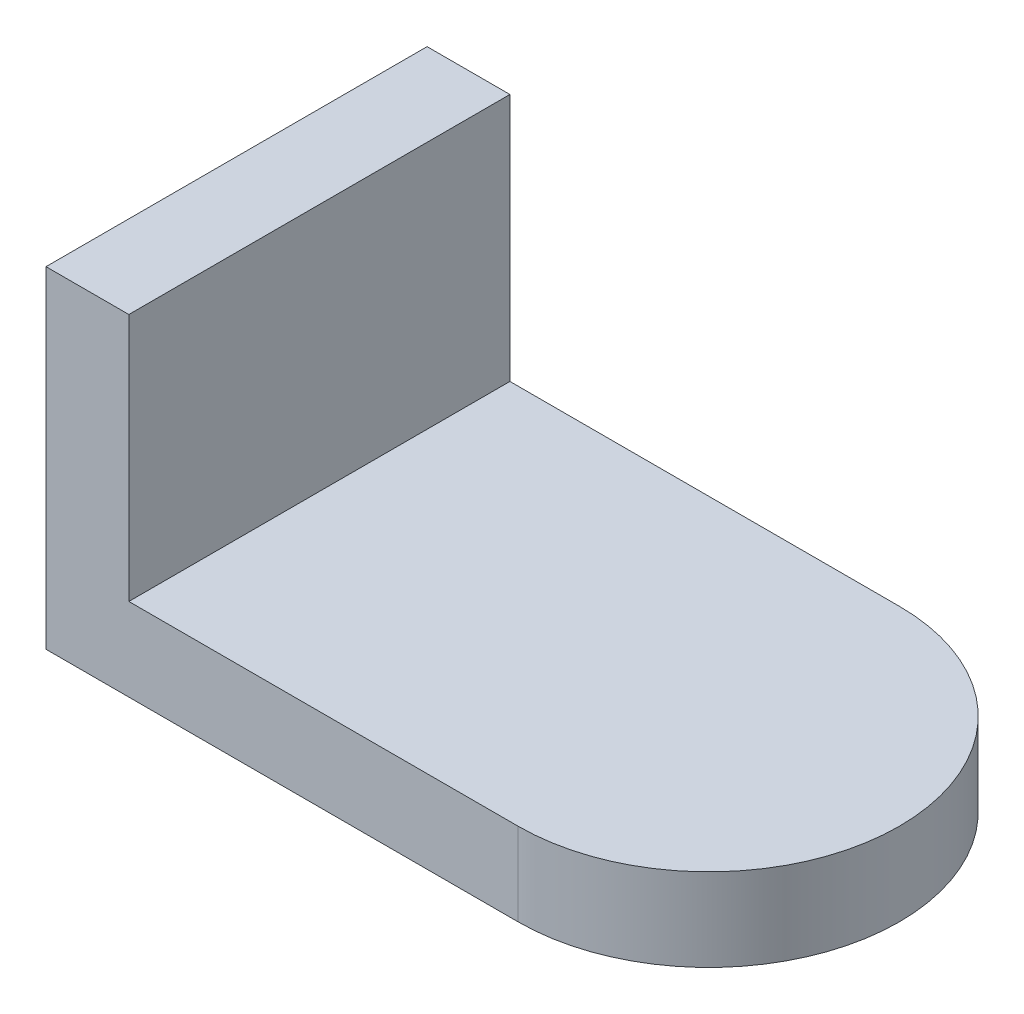
ISO-10303-21;
HEADER;
FILE_DESCRIPTION(('STEP AP214'),'2;1');
FILE_NAME('part.step','',(''),(''),'','','');
FILE_SCHEMA(('AUTOMOTIVE_DESIGN { 1 0 10303 214 1 1 1 1 }'));
ENDSEC;
DATA;
#1=APPLICATION_CONTEXT('core data for automotive mechanical design processes');
#2=APPLICATION_PROTOCOL_DEFINITION('international standard','automotive_design',2000,#1);
#3=PRODUCT_CONTEXT('',#1,'mechanical');
#4=PRODUCT('Part','Part','',(#3));
#5=PRODUCT_RELATED_PRODUCT_CATEGORY('part','',(#4));
#6=PRODUCT_DEFINITION_FORMATION('','',#4);
#7=PRODUCT_DEFINITION_CONTEXT('part definition',#1,'design');
#8=PRODUCT_DEFINITION('design','',#6,#7);
#9=PRODUCT_DEFINITION_SHAPE('','',#8);
#10=(LENGTH_UNIT() NAMED_UNIT(*) SI_UNIT(.MILLI.,.METRE.));
#11=(NAMED_UNIT(*) PLANE_ANGLE_UNIT() SI_UNIT($,.RADIAN.));
#12=(NAMED_UNIT(*) SI_UNIT($,.STERADIAN.) SOLID_ANGLE_UNIT());
#13=UNCERTAINTY_MEASURE_WITH_UNIT(LENGTH_MEASURE(1.E-05),#10,'distance_accuracy_value','');
#14=(GEOMETRIC_REPRESENTATION_CONTEXT(3) GLOBAL_UNCERTAINTY_ASSIGNED_CONTEXT((#13)) GLOBAL_UNIT_ASSIGNED_CONTEXT((#10,
#11,#12)) REPRESENTATION_CONTEXT('',''));
#15=CARTESIAN_POINT('',(0.,0.,0.));
#16=DIRECTION('',(0.,0.,1.));
#17=DIRECTION('',(1.,0.,0.));
#18=AXIS2_PLACEMENT_3D('',#15,#16,#17);
#19=CARTESIAN_POINT('',(-1.45,-0.2,0.635000000000001));
#20=DIRECTION('',(0.,0.,-1.));
#21=DIRECTION('',(-1.,0.,0.));
#22=AXIS2_PLACEMENT_3D('',#19,#20,#21);
#23=PLANE('',#22);
#24=DIRECTION('',(0.,-1.,0.));
#25=VECTOR('',#24,1.);
#26=CARTESIAN_POINT('',(-1.5,-0.2,0.635000000000001));
#27=LINE('',#26,#25);
#28=CARTESIAN_POINT('',(-1.5,-0.2,0.635000000000001));
#29=VERTEX_POINT('',#28);
#30=CARTESIAN_POINT('',(-1.5,-0.4,0.635000000000001));
#31=VERTEX_POINT('',#30);
#32=EDGE_CURVE('E11',#29,#31,#27,.T.);
#33=ORIENTED_EDGE('',*,*,#32,.F.);
#34=DIRECTION('',(-1.,0.,0.));
#35=VECTOR('',#34,1.);
#36=CARTESIAN_POINT('',(-1.45,-0.2,0.635000000000001));
#37=LINE('',#36,#35);
#38=CARTESIAN_POINT('',(-1.45,-0.2,0.635000000000001));
#39=VERTEX_POINT('',#38);
#40=EDGE_CURVE('E24',#39,#29,#37,.T.);
#41=ORIENTED_EDGE('',*,*,#40,.F.);
#42=DIRECTION('',(0.,-1.,0.));
#43=VECTOR('',#42,1.);
#44=CARTESIAN_POINT('',(-1.45,-0.2,0.635000000000001));
#45=LINE('',#44,#43);
#46=CARTESIAN_POINT('',(-1.45,-0.35,0.635000000000001));
#47=VERTEX_POINT('',#46);
#48=EDGE_CURVE('E116',#39,#47,#45,.T.);
#49=ORIENTED_EDGE('',*,*,#48,.T.);
#50=DIRECTION('',(1.,0.,0.));
#51=VECTOR('',#50,1.);
#52=CARTESIAN_POINT('',(-1.45,-0.35,0.635000000000001));
#53=LINE('',#52,#51);
#54=CARTESIAN_POINT('',(-1.215,-0.35,0.635000000000001));
#55=VERTEX_POINT('',#54);
#56=EDGE_CURVE('E90',#47,#55,#53,.T.);
#57=ORIENTED_EDGE('',*,*,#56,.T.);
#58=DIRECTION('',(0.,-1.,0.));
#59=VECTOR('',#58,1.);
#60=CARTESIAN_POINT('',(-1.215,-0.35,0.635000000000001));
#61=LINE('',#60,#59);
#62=CARTESIAN_POINT('',(-1.215,-0.4,0.635000000000001));
#63=VERTEX_POINT('',#62);
#64=EDGE_CURVE('E113',#55,#63,#61,.T.);
#65=ORIENTED_EDGE('',*,*,#64,.T.);
#66=DIRECTION('',(-1.,0.,0.));
#67=VECTOR('',#66,1.);
#68=CARTESIAN_POINT('',(-1.45,-0.4,0.635000000000001));
#69=LINE('',#68,#67);
#70=EDGE_CURVE('E111',#63,#31,#69,.T.);
#71=ORIENTED_EDGE('',*,*,#70,.T.);
#72=EDGE_LOOP('',(#33,#41,#49,#57,#65,#71));
#73=FACE_BOUND('',#72,.T.);
#74=ADVANCED_FACE('F17',(#73),#23,.T.);
#75=CARTESIAN_POINT('',(-1.45,-0.2,0.635000000000001));
#76=DIRECTION('',(0.,1.,0.));
#77=DIRECTION('',(0.,0.,1.));
#78=AXIS2_PLACEMENT_3D('',#75,#76,#77);
#79=PLANE('',#78);
#80=DIRECTION('',(0.,0.,-1.));
#81=VECTOR('',#80,1.);
#82=CARTESIAN_POINT('',(-1.5,-0.2,0.635000000000001));
#83=LINE('',#82,#81);
#84=CARTESIAN_POINT('',(-1.5,-0.2,0.865));
#85=VERTEX_POINT('',#84);
#86=EDGE_CURVE('E109',#85,#29,#83,.T.);
#87=ORIENTED_EDGE('',*,*,#86,.F.);
#88=DIRECTION('',(-1.,0.,0.));
#89=VECTOR('',#88,1.);
#90=CARTESIAN_POINT('',(-1.45,-0.2,0.865));
#91=LINE('',#90,#89);
#92=CARTESIAN_POINT('',(-1.45,-0.2,0.865));
#93=VERTEX_POINT('',#92);
#94=EDGE_CURVE('E107',#93,#85,#91,.T.);
#95=ORIENTED_EDGE('',*,*,#94,.F.);
#96=DIRECTION('',(0.,0.,-1.));
#97=VECTOR('',#96,1.);
#98=CARTESIAN_POINT('',(-1.45,-0.2,0.635000000000001));
#99=LINE('',#98,#97);
#100=EDGE_CURVE('E85',#93,#39,#99,.T.);
#101=ORIENTED_EDGE('',*,*,#100,.T.);
#102=ORIENTED_EDGE('',*,*,#40,.T.);
#103=EDGE_LOOP('',(#87,#95,#101,#102));
#104=FACE_BOUND('',#103,.T.);
#105=ADVANCED_FACE('F118',(#104),#79,.T.);
#106=CARTESIAN_POINT('',(-1.45,-0.2,0.865));
#107=DIRECTION('',(0.,0.,1.));
#108=DIRECTION('',(0.,-1.,0.));
#109=AXIS2_PLACEMENT_3D('',#106,#107,#108);
#110=PLANE('',#109);
#111=DIRECTION('',(0.,1.,0.));
#112=VECTOR('',#111,1.);
#113=CARTESIAN_POINT('',(-1.5,-0.2,0.865));
#114=LINE('',#113,#112);
#115=CARTESIAN_POINT('',(-1.5,-0.4,0.865000000000001));
#116=VERTEX_POINT('',#115);
#117=EDGE_CURVE('E103',#116,#85,#114,.T.);
#118=ORIENTED_EDGE('',*,*,#117,.F.);
#119=DIRECTION('',(-1.,0.,0.));
#120=VECTOR('',#119,1.);
#121=CARTESIAN_POINT('',(-1.45,-0.4,0.865000000000001));
#122=LINE('',#121,#120);
#123=CARTESIAN_POINT('',(-1.215,-0.4,0.865000000000001));
#124=VERTEX_POINT('',#123);
#125=EDGE_CURVE('E100',#124,#116,#122,.T.);
#126=ORIENTED_EDGE('',*,*,#125,.F.);
#127=DIRECTION('',(0.,-1.,0.));
#128=VECTOR('',#127,1.);
#129=CARTESIAN_POINT('',(-1.215,-0.35,0.865000000000001));
#130=LINE('',#129,#128);
#131=CARTESIAN_POINT('',(-1.215,-0.35,0.865000000000001));
#132=VERTEX_POINT('',#131);
#133=EDGE_CURVE('E72',#132,#124,#130,.T.);
#134=ORIENTED_EDGE('',*,*,#133,.F.);
#135=DIRECTION('',(-1.,0.,0.));
#136=VECTOR('',#135,1.);
#137=CARTESIAN_POINT('',(-1.45,-0.35,0.865000000000001));
#138=LINE('',#137,#136);
#139=CARTESIAN_POINT('',(-1.45,-0.35,0.865000000000001));
#140=VERTEX_POINT('',#139);
#141=EDGE_CURVE('E66',#132,#140,#138,.T.);
#142=ORIENTED_EDGE('',*,*,#141,.T.);
#143=DIRECTION('',(0.,1.,0.));
#144=VECTOR('',#143,1.);
#145=CARTESIAN_POINT('',(-1.45,-0.2,0.865));
#146=LINE('',#145,#144);
#147=EDGE_CURVE('E70',#140,#93,#146,.T.);
#148=ORIENTED_EDGE('',*,*,#147,.T.);
#149=ORIENTED_EDGE('',*,*,#94,.T.);
#150=EDGE_LOOP('',(#118,#126,#134,#142,#148,#149));
#151=FACE_BOUND('',#150,.T.);
#152=ADVANCED_FACE('F68',(#151),#110,.T.);
#153=CARTESIAN_POINT('',(-1.45,-0.4,0.635000000000001));
#154=DIRECTION('',(0.,-1.,0.));
#155=DIRECTION('',(0.,0.,-1.));
#156=AXIS2_PLACEMENT_3D('',#153,#154,#155);
#157=PLANE('',#156);
#158=DIRECTION('',(0.,0.,1.));
#159=VECTOR('',#158,1.);
#160=CARTESIAN_POINT('',(-1.5,-0.4,0.635000000000001));
#161=LINE('',#160,#159);
#162=EDGE_CURVE('E86',#31,#116,#161,.T.);
#163=ORIENTED_EDGE('',*,*,#162,.F.);
#164=ORIENTED_EDGE('',*,*,#70,.F.);
#165=CARTESIAN_POINT('',(-1.215,-0.4,0.750000000000001));
#166=DIRECTION('',(0.,-1.,0.));
#167=DIRECTION('',(0.,0.,1.));
#168=AXIS2_PLACEMENT_3D('',#165,#166,#167);
#169=CIRCLE('',#168,0.115);
#170=EDGE_CURVE('E91',#63,#124,#169,.T.);
#171=ORIENTED_EDGE('',*,*,#170,.T.);
#172=ORIENTED_EDGE('',*,*,#125,.T.);
#173=EDGE_LOOP('',(#163,#164,#171,#172));
#174=FACE_BOUND('',#173,.T.);
#175=ADVANCED_FACE('F122',(#174),#157,.T.);
#176=CARTESIAN_POINT('',(-1.45,0.,0.));
#177=DIRECTION('',(-1.,0.,0.));
#178=DIRECTION('',(0.,0.,1.));
#179=AXIS2_PLACEMENT_3D('',#176,#177,#178);
#180=PLANE('',#179);
#181=ORIENTED_EDGE('',*,*,#147,.F.);
#182=DIRECTION('',(0.,0.,-1.));
#183=VECTOR('',#182,1.);
#184=CARTESIAN_POINT('',(-1.45,-0.35,0.635000000000001));
#185=LINE('',#184,#183);
#186=EDGE_CURVE('E83',#140,#47,#185,.T.);
#187=ORIENTED_EDGE('',*,*,#186,.T.);
#188=ORIENTED_EDGE('',*,*,#48,.F.);
#189=ORIENTED_EDGE('',*,*,#100,.F.);
#190=EDGE_LOOP('',(#181,#187,#188,#189));
#191=FACE_BOUND('',#190,.T.);
#192=ADVANCED_FACE('F81',(#191),#180,.F.);
#193=CARTESIAN_POINT('',(-1.5,0.,0.));
#194=DIRECTION('',(-1.,0.,0.));
#195=DIRECTION('',(0.,0.,1.));
#196=AXIS2_PLACEMENT_3D('',#193,#194,#195);
#197=PLANE('',#196);
#198=ORIENTED_EDGE('',*,*,#32,.T.);
#199=ORIENTED_EDGE('',*,*,#162,.T.);
#200=ORIENTED_EDGE('',*,*,#117,.T.);
#201=ORIENTED_EDGE('',*,*,#86,.T.);
#202=EDGE_LOOP('',(#198,#199,#200,#201));
#203=FACE_BOUND('',#202,.T.);
#204=ADVANCED_FACE('F119',(#203),#197,.T.);
#205=CARTESIAN_POINT('',(-1.215,-0.35,0.750000000000001));
#206=DIRECTION('',(0.,-1.,0.));
#207=DIRECTION('',(0.,0.,-1.));
#208=AXIS2_PLACEMENT_3D('',#205,#206,#207);
#209=CYLINDRICAL_SURFACE('',#208,0.115);
#210=ORIENTED_EDGE('',*,*,#170,.F.);
#211=ORIENTED_EDGE('',*,*,#64,.F.);
#212=CARTESIAN_POINT('',(-1.215,-0.35,0.750000000000001));
#213=DIRECTION('',(0.,-1.,0.));
#214=DIRECTION('',(0.,0.,1.));
#215=AXIS2_PLACEMENT_3D('',#212,#213,#214);
#216=CIRCLE('',#215,0.115);
#217=EDGE_CURVE('E92',#55,#132,#216,.T.);
#218=ORIENTED_EDGE('',*,*,#217,.T.);
#219=ORIENTED_EDGE('',*,*,#133,.T.);
#220=EDGE_LOOP('',(#210,#211,#218,#219));
#221=FACE_BOUND('',#220,.T.);
#222=ADVANCED_FACE('F127',(#221),#209,.T.);
#223=CARTESIAN_POINT('',(-1.215,-0.35,0.750000000000001));
#224=DIRECTION('',(0.,1.,0.));
#225=DIRECTION('',(0.,0.,1.));
#226=AXIS2_PLACEMENT_3D('',#223,#224,#225);
#227=PLANE('',#226);
#228=ORIENTED_EDGE('',*,*,#186,.F.);
#229=ORIENTED_EDGE('',*,*,#141,.F.);
#230=ORIENTED_EDGE('',*,*,#217,.F.);
#231=ORIENTED_EDGE('',*,*,#56,.F.);
#232=EDGE_LOOP('',(#228,#229,#230,#231));
#233=FACE_BOUND('',#232,.T.);
#234=ADVANCED_FACE('F89',(#233),#227,.T.);
#235=CLOSED_SHELL('',(#74,#105,#152,#175,#192,#204,#222,#234));
#236=MANIFOLD_SOLID_BREP('B1',#235);
#237=ADVANCED_BREP_SHAPE_REPRESENTATION('',(#18,#236),#14);
#238=SHAPE_DEFINITION_REPRESENTATION(#9,#237);
ENDSEC;
END-ISO-10303-21;
